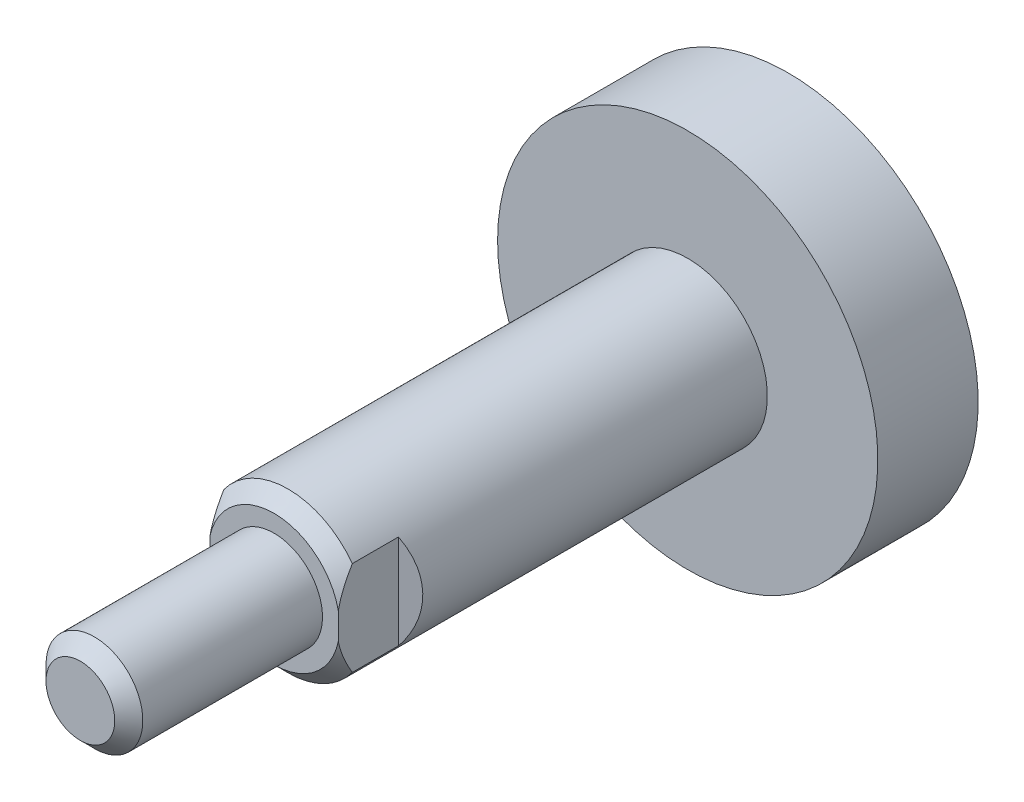
ISO-10303-21;
HEADER;
FILE_DESCRIPTION(('STEP AP214'),'2;1');
FILE_NAME('part.step','',(''),(''),'','','');
FILE_SCHEMA(('AUTOMOTIVE_DESIGN { 1 0 10303 214 1 1 1 1 }'));
ENDSEC;
DATA;
#1=APPLICATION_CONTEXT('core data for automotive mechanical design processes');
#2=APPLICATION_PROTOCOL_DEFINITION('international standard','automotive_design',2000,#1);
#3=PRODUCT_CONTEXT('',#1,'mechanical');
#4=PRODUCT('Part','Part','',(#3));
#5=PRODUCT_RELATED_PRODUCT_CATEGORY('part','',(#4));
#6=PRODUCT_DEFINITION_FORMATION('','',#4);
#7=PRODUCT_DEFINITION_CONTEXT('part definition',#1,'design');
#8=PRODUCT_DEFINITION('design','',#6,#7);
#9=PRODUCT_DEFINITION_SHAPE('','',#8);
#10=(LENGTH_UNIT() NAMED_UNIT(*) SI_UNIT(.MILLI.,.METRE.));
#11=(NAMED_UNIT(*) PLANE_ANGLE_UNIT() SI_UNIT($,.RADIAN.));
#12=(NAMED_UNIT(*) SI_UNIT($,.STERADIAN.) SOLID_ANGLE_UNIT());
#13=UNCERTAINTY_MEASURE_WITH_UNIT(LENGTH_MEASURE(1.E-05),#10,'distance_accuracy_value','');
#14=(GEOMETRIC_REPRESENTATION_CONTEXT(3) GLOBAL_UNCERTAINTY_ASSIGNED_CONTEXT((#13)) GLOBAL_UNIT_ASSIGNED_CONTEXT((#10,
#11,#12)) REPRESENTATION_CONTEXT('',''));
#15=CARTESIAN_POINT('',(0.,0.,0.));
#16=DIRECTION('',(0.,0.,1.));
#17=DIRECTION('',(1.,0.,0.));
#18=AXIS2_PLACEMENT_3D('',#15,#16,#17);
#19=CARTESIAN_POINT('',(0.,0.,35.266));
#20=DIRECTION('',(0.,0.,1.));
#21=DIRECTION('',(1.,0.,0.));
#22=AXIS2_PLACEMENT_3D('',#19,#20,#21);
#23=PLANE('',#22);
#24=CARTESIAN_POINT('',(0.,0.,35.2659999999219));
#25=DIRECTION('',(0.,0.,-1.));
#26=DIRECTION('',(-1.,0.,0.));
#27=AXIS2_PLACEMENT_3D('',#24,#25,#26);
#28=CIRCLE('',#27,1.71299999999519);
#29=CARTESIAN_POINT('',(-1.71299999999519,0.,35.2659999999219));
#30=VERTEX_POINT('',#29);
#31=EDGE_CURVE('E21',#30,#30,#28,.T.);
#32=ORIENTED_EDGE('',*,*,#31,.F.);
#33=EDGE_LOOP('',(#32));
#34=FACE_BOUND('',#33,.T.);
#35=ADVANCED_FACE('F18',(#34),#23,.T.);
#36=CARTESIAN_POINT('',(0.,0.,34.5659999999839));
#37=DIRECTION('',(0.,0.,-1.));
#38=DIRECTION('',(-1.,0.,0.));
#39=AXIS2_PLACEMENT_3D('',#36,#37,#38);
#40=CONICAL_SURFACE('',#39,2.41299999993316,0.785398163397448);
#41=ORIENTED_EDGE('',*,*,#31,.T.);
#42=EDGE_LOOP('',(#41));
#43=FACE_BOUND('',#42,.T.);
#44=CARTESIAN_POINT('',(0.,0.,34.566));
#45=DIRECTION('',(0.,0.,-1.));
#46=DIRECTION('',(-1.,0.,0.));
#47=AXIS2_PLACEMENT_3D('',#44,#45,#46);
#48=CIRCLE('',#47,2.413);
#49=CARTESIAN_POINT('',(-2.413,0.,34.566));
#50=VERTEX_POINT('',#49);
#51=EDGE_CURVE('E191',#50,#50,#48,.T.);
#52=ORIENTED_EDGE('',*,*,#51,.F.);
#53=EDGE_LOOP('',(#52));
#54=FACE_BOUND('',#53,.T.);
#55=ADVANCED_FACE('F199',(#43,#54),#40,.T.);
#56=CARTESIAN_POINT('',(0.,0.,35.266));
#57=DIRECTION('',(0.,0.,-1.));
#58=DIRECTION('',(-1.,0.,0.));
#59=AXIS2_PLACEMENT_3D('',#56,#57,#58);
#60=CYLINDRICAL_SURFACE('',#59,2.413);
#61=ORIENTED_EDGE('',*,*,#51,.T.);
#62=EDGE_LOOP('',(#61));
#63=FACE_BOUND('',#62,.T.);
#64=CARTESIAN_POINT('',(0.,0.,25.614));
#65=DIRECTION('',(0.,0.,-1.));
#66=DIRECTION('',(-1.,0.,0.));
#67=AXIS2_PLACEMENT_3D('',#64,#65,#66);
#68=CIRCLE('',#67,2.413);
#69=CARTESIAN_POINT('',(-2.413,0.,25.614));
#70=VERTEX_POINT('',#69);
#71=EDGE_CURVE('E73',#70,#70,#68,.F.);
#72=ORIENTED_EDGE('',*,*,#71,.T.);
#73=EDGE_LOOP('',(#72));
#74=FACE_BOUND('',#73,.T.);
#75=ADVANCED_FACE('F205',(#63,#74),#60,.T.);
#76=CARTESIAN_POINT('',(0.,0.,25.614));
#77=DIRECTION('',(0.,0.,-1.));
#78=DIRECTION('',(0.,1.,0.));
#79=AXIS2_PLACEMENT_3D('',#76,#77,#78);
#80=PLANE('',#79);
#81=ORIENTED_EDGE('',*,*,#71,.F.);
#82=EDGE_LOOP('',(#81));
#83=FACE_BOUND('',#82,.T.);
#84=DIRECTION('',(0.,1.,0.));
#85=VECTOR('',#84,1.);
#86=CARTESIAN_POINT('',(3.2,-9.475,25.614));
#87=LINE('',#86,#85);
#88=CARTESIAN_POINT('',(3.2,-0.668102537170798,25.6139999999809));
#89=VERTEX_POINT('',#88);
#90=CARTESIAN_POINT('',(3.2,0.668102537154727,25.6139999999842));
#91=VERTEX_POINT('',#90);
#92=EDGE_CURVE('E66',#89,#91,#87,.T.);
#93=ORIENTED_EDGE('',*,*,#92,.T.);
#94=CARTESIAN_POINT('',(0.,0.,25.6139999999618));
#95=DIRECTION('',(0.,0.,-1.));
#96=DIRECTION('',(0.,1.,0.));
#97=AXIS2_PLACEMENT_3D('',#94,#95,#96);
#98=CIRCLE('',#97,3.26900000004571);
#99=CARTESIAN_POINT('',(-3.2,0.668102537155263,25.6139999999841));
#100=VERTEX_POINT('',#99);
#101=EDGE_CURVE('E90',#100,#91,#98,.T.);
#102=ORIENTED_EDGE('',*,*,#101,.F.);
#103=DIRECTION('',(0.,1.,0.));
#104=VECTOR('',#103,1.);
#105=CARTESIAN_POINT('',(-3.2,-9.475,25.614));
#106=LINE('',#105,#104);
#107=CARTESIAN_POINT('',(-3.2,-0.668102537154732,25.6139999999842));
#108=VERTEX_POINT('',#107);
#109=EDGE_CURVE('E67',#100,#108,#106,.F.);
#110=ORIENTED_EDGE('',*,*,#109,.T.);
#111=CARTESIAN_POINT('',(0.,0.,25.6139999999618));
#112=DIRECTION('',(0.,0.,-1.));
#113=DIRECTION('',(0.,1.,0.));
#114=AXIS2_PLACEMENT_3D('',#111,#112,#113);
#115=CIRCLE('',#114,3.26900000004571);
#116=EDGE_CURVE('E62',#89,#108,#115,.T.);
#117=ORIENTED_EDGE('',*,*,#116,.F.);
#118=EDGE_LOOP('',(#93,#102,#110,#117));
#119=FACE_BOUND('',#118,.T.);
#120=ADVANCED_FACE('F64',(#83,#119),#80,.F.);
#121=CARTESIAN_POINT('',(0.,0.,24.9140000000807));
#122=DIRECTION('',(0.,0.,-1.));
#123=DIRECTION('',(0.,1.,0.));
#124=AXIS2_PLACEMENT_3D('',#121,#122,#123);
#125=CONICAL_SURFACE('',#124,3.96899999998368,0.785398163438051);
#126=CARTESIAN_POINT('',(-3.20000000000324,-0.668102537045559,25.6140000000079));
#127=CARTESIAN_POINT('',(-3.20000000000116,-0.791923989307162,25.5887118948215));
#128=CARTESIAN_POINT('',(-3.20000000000031,-0.914214432197644,25.5569533814339));
#129=CARTESIAN_POINT('',(-3.19999999999969,-1.15522323067472,25.482786734809));
#130=CARTESIAN_POINT('',(-3.19999999999992,-1.27394966585461,25.440405109426));
#131=CARTESIAN_POINT('',(-3.20000000000008,-1.50692397331803,25.3475394481742));
#132=CARTESIAN_POINT('',(-3.20000000000002,-1.62120166838874,25.2971285477279));
#133=CARTESIAN_POINT('',(-3.19999999999998,-1.8466563464418,25.1897204575799));
#134=CARTESIAN_POINT('',(-3.2,-1.95783200288132,25.1327205021669));
#135=CARTESIAN_POINT('',(-3.2,-2.1147772258552,25.047544782855));
#136=CARTESIAN_POINT('',(-3.2,-2.161701362435,25.021462011141));
#137=CARTESIAN_POINT('',(-3.2,-2.25515024754835,24.9683835316909));
#138=CARTESIAN_POINT('',(-3.2,-2.30167405357722,24.9413861634868));
#139=CARTESIAN_POINT('',(-3.2,-2.34796954838271,24.9140000000477));
#140=B_SPLINE_CURVE_WITH_KNOTS('',3,(#126,#127,#128,#129,#130,#131,#132,#133,#134,#135,#136,
#137,#138,#139),.UNSPECIFIED.,.F.,.F.,(4,2,2,2,2,2,4),(0.,0.378663318923574,0.756391005243895,
1.13085654278463,1.50547983437227,1.66653163363144,1.82789340191547),.UNSPECIFIED.);
#141=CARTESIAN_POINT('',(-3.2,-2.3479695483686,24.9140000000238));
#142=VERTEX_POINT('',#141);
#143=EDGE_CURVE('E116',#108,#142,#140,.T.);
#144=ORIENTED_EDGE('',*,*,#143,.T.);
#145=CARTESIAN_POINT('',(0.,0.,24.914));
#146=DIRECTION('',(0.,0.,-1.));
#147=DIRECTION('',(-1.,0.,0.));
#148=AXIS2_PLACEMENT_3D('',#145,#146,#147);
#149=CIRCLE('',#148,3.969);
#150=CARTESIAN_POINT('',(3.2,-2.3479695483686,24.9140000000238));
#151=VERTEX_POINT('',#150);
#152=EDGE_CURVE('E86',#151,#142,#149,.T.);
#153=ORIENTED_EDGE('',*,*,#152,.F.);
#154=CARTESIAN_POINT('',(3.2,-2.34796954838271,24.9140000000477));
#155=CARTESIAN_POINT('',(3.2,-2.28227540638902,24.9528576848915));
#156=CARTESIAN_POINT('',(3.2,-2.21612013329714,24.9909397042438));
#157=CARTESIAN_POINT('',(3.2,-2.08277615458881,25.065293160087));
#158=CARTESIAN_POINT('',(3.2,-2.01558715530726,25.1015640691656));
#159=CARTESIAN_POINT('',(3.2,-1.81330543751406,25.2067462963586));
#160=CARTESIAN_POINT('',(3.2,-1.6765834937986,25.2725768397312));
#161=CARTESIAN_POINT('',(3.2,-1.39788707534561,25.3932563066866));
#162=CARTESIAN_POINT('',(3.2,-1.25590184064602,25.4480810761872));
#163=CARTESIAN_POINT('',(3.2,-0.966123687795267,25.5431571719073));
#164=CARTESIAN_POINT('',(3.2,-0.81829778980787,25.5833066541209));
#165=CARTESIAN_POINT('',(3.2,-0.668102537044839,25.6140000000067));
#166=B_SPLINE_CURVE_WITH_KNOTS('',3,(#154,#155,#156,#157,#158,#159,#160,#161,#162,#163,#164,
#165),.UNSPECIFIED.,.F.,.F.,(4,2,2,2,2,4),(0.,0.228972156487963,0.458010607517393,
0.91289148643811,1.36876002116686,1.82773469580556),.UNSPECIFIED.);
#167=EDGE_CURVE('E79',#151,#89,#166,.T.);
#168=ORIENTED_EDGE('',*,*,#167,.T.);
#169=ORIENTED_EDGE('',*,*,#116,.T.);
#170=EDGE_LOOP('',(#144,#153,#168,#169));
#171=FACE_BOUND('',#170,.T.);
#172=ADVANCED_FACE('F85',(#171),#125,.T.);
#173=CARTESIAN_POINT('',(3.2,-9.475,22.614));
#174=DIRECTION('',(-0.500000000000005,0.,-0.866025403784436));
#175=DIRECTION('',(-0.866025403784436,0.,0.500000000000005));
#176=AXIS2_PLACEMENT_3D('',#173,#174,#175);
#177=PLANE('',#176);
#178=CARTESIAN_POINT('',(0.,0.,24.4615208614068));
#179=DIRECTION('',(-0.500000000000005,0.,-0.866025403784436));
#180=DIRECTION('',(0.866025403784436,0.,-0.500000000000005));
#181=AXIS2_PLACEMENT_3D('',#178,#179,#180);
#182=ELLIPSE('',#181,4.58300643682726,3.969);
#183=CARTESIAN_POINT('',(3.2,2.34796954835449,22.614));
#184=VERTEX_POINT('',#183);
#185=CARTESIAN_POINT('',(3.2,-2.34796954835449,22.614));
#186=VERTEX_POINT('',#185);
#187=EDGE_CURVE('E175',#184,#186,#182,.T.);
#188=ORIENTED_EDGE('',*,*,#187,.F.);
#189=DIRECTION('',(0.,1.,0.));
#190=VECTOR('',#189,1.);
#191=CARTESIAN_POINT('',(3.2,-9.475,22.614));
#192=LINE('',#191,#190);
#193=EDGE_CURVE('E87',#184,#186,#192,.F.);
#194=ORIENTED_EDGE('',*,*,#193,.T.);
#195=EDGE_LOOP('',(#188,#194));
#196=FACE_BOUND('',#195,.T.);
#197=ADVANCED_FACE('F111',(#196),#177,.F.);
#198=CARTESIAN_POINT('',(-3.2,-9.475,22.614));
#199=DIRECTION('',(0.500000000000004,0.,-0.866025403784436));
#200=DIRECTION('',(-0.866025403784436,0.,-0.500000000000004));
#201=AXIS2_PLACEMENT_3D('',#198,#199,#200);
#202=PLANE('',#201);
#203=CARTESIAN_POINT('',(0.,0.,24.4615208614068));
#204=DIRECTION('',(0.500000000000004,0.,-0.866025403784436));
#205=DIRECTION('',(-0.866025403784436,0.,-0.500000000000004));
#206=AXIS2_PLACEMENT_3D('',#203,#204,#205);
#207=ELLIPSE('',#206,4.58300643682726,3.969);
#208=CARTESIAN_POINT('',(-3.2,-2.34796954835449,22.614));
#209=VERTEX_POINT('',#208);
#210=CARTESIAN_POINT('',(-3.2,2.34796954835449,22.614));
#211=VERTEX_POINT('',#210);
#212=EDGE_CURVE('E172',#209,#211,#207,.T.);
#213=ORIENTED_EDGE('',*,*,#212,.F.);
#214=DIRECTION('',(0.,1.,0.));
#215=VECTOR('',#214,1.);
#216=CARTESIAN_POINT('',(-3.2,-9.475,22.614));
#217=LINE('',#216,#215);
#218=EDGE_CURVE('E72',#209,#211,#217,.T.);
#219=ORIENTED_EDGE('',*,*,#218,.T.);
#220=EDGE_LOOP('',(#213,#219));
#221=FACE_BOUND('',#220,.T.);
#222=ADVANCED_FACE('F129',(#221),#202,.F.);
#223=CARTESIAN_POINT('',(-3.2,-9.475,25.614));
#224=DIRECTION('',(1.,0.,0.));
#225=DIRECTION('',(0.,0.,-1.));
#226=AXIS2_PLACEMENT_3D('',#223,#224,#225);
#227=PLANE('',#226);
#228=ORIENTED_EDGE('',*,*,#143,.F.);
#229=ORIENTED_EDGE('',*,*,#109,.F.);
#230=CARTESIAN_POINT('',(-3.19999999998987,2.34796954838807,24.9140000000384));
#231=CARTESIAN_POINT('',(-3.19999999999627,2.28227540639574,24.9528576848853));
#232=CARTESIAN_POINT('',(-3.19999999999898,2.21612013330425,24.9909397042391));
#233=CARTESIAN_POINT('',(-3.20000000000102,2.08277615459583,25.0652931600838));
#234=CARTESIAN_POINT('',(-3.20000000000036,2.01558715531381,25.1015640691624));
#235=CARTESIAN_POINT('',(-3.19999999999929,1.81330543751945,25.2067462963555));
#236=CARTESIAN_POINT('',(-3.1999999999998,1.67658349380355,25.2725768397288));
#237=CARTESIAN_POINT('',(-3.2000000000002,1.39788707534955,25.3932563066852));
#238=CARTESIAN_POINT('',(-3.2000000000001,1.2559018406494,25.4480810761861));
#239=CARTESIAN_POINT('',(-3.1999999999999,0.966123687797418,25.5431571719066));
#240=CARTESIAN_POINT('',(-3.19999999999979,0.818297789809342,25.5833066541205));
#241=CARTESIAN_POINT('',(-3.2,0.668102537045687,25.6140000000065));
#242=B_SPLINE_CURVE_WITH_KNOTS('',3,(#230,#231,#232,#233,#234,#235,#236,#237,#238,#239,#240,
#241),.UNSPECIFIED.,.F.,.F.,(4,2,2,2,2,4),(0.,0.228972156489184,0.458010607519769,
0.912891486442607,1.3687600211732,1.82773469581398),.UNSPECIFIED.);
#243=CARTESIAN_POINT('',(-3.2,2.34796954835449,24.9140000000322));
#244=VERTEX_POINT('',#243);
#245=EDGE_CURVE('E121',#244,#100,#242,.T.);
#246=ORIENTED_EDGE('',*,*,#245,.F.);
#247=DIRECTION('',(0.,0.,-1.));
#248=VECTOR('',#247,1.);
#249=CARTESIAN_POINT('',(-3.2,2.34796954835449,36.8400272581176));
#250=LINE('',#249,#248);
#251=EDGE_CURVE('E174',#211,#244,#250,.F.);
#252=ORIENTED_EDGE('',*,*,#251,.F.);
#253=ORIENTED_EDGE('',*,*,#218,.F.);
#254=DIRECTION('',(0.,0.,-1.));
#255=VECTOR('',#254,1.);
#256=CARTESIAN_POINT('',(-3.2,-2.34796954835449,36.8400272581176));
#257=LINE('',#256,#255);
#258=EDGE_CURVE('E177',#142,#209,#257,.T.);
#259=ORIENTED_EDGE('',*,*,#258,.F.);
#260=EDGE_LOOP('',(#228,#229,#246,#252,#253,#259));
#261=FACE_BOUND('',#260,.T.);
#262=ADVANCED_FACE('F125',(#261),#227,.F.);
#263=CARTESIAN_POINT('',(0.,0.,24.9140000000807));
#264=DIRECTION('',(0.,0.,-1.));
#265=DIRECTION('',(0.,1.,0.));
#266=AXIS2_PLACEMENT_3D('',#263,#264,#265);
#267=CONICAL_SURFACE('',#266,3.96899999998368,0.785398163438051);
#268=ORIENTED_EDGE('',*,*,#245,.T.);
#269=ORIENTED_EDGE('',*,*,#101,.T.);
#270=CARTESIAN_POINT('',(3.20000000000325,0.668102537045564,25.6140000000079));
#271=CARTESIAN_POINT('',(3.20000000000117,0.791923989307168,25.5887118948215));
#272=CARTESIAN_POINT('',(3.20000000000031,0.914214432197651,25.5569533814339));
#273=CARTESIAN_POINT('',(3.19999999999969,1.15522323067473,25.482786734809));
#274=CARTESIAN_POINT('',(3.19999999999992,1.27394966585462,25.440405109426));
#275=CARTESIAN_POINT('',(3.20000000000008,1.50692397331804,25.3475394481742));
#276=CARTESIAN_POINT('',(3.20000000000003,1.62120166838875,25.2971285477279));
#277=CARTESIAN_POINT('',(3.19999999999998,1.84665634644181,25.1897204575799));
#278=CARTESIAN_POINT('',(3.2,1.95783200288133,25.1327205021669));
#279=CARTESIAN_POINT('',(3.20000000000001,2.11477722585521,25.0475447828549));
#280=CARTESIAN_POINT('',(3.2,2.161701362435,25.021462011141));
#281=CARTESIAN_POINT('',(3.2,2.25515024754835,24.9683835316909));
#282=CARTESIAN_POINT('',(3.2,2.30167405357722,24.9413861634868));
#283=CARTESIAN_POINT('',(3.2,2.34796954838271,24.9140000000477));
#284=B_SPLINE_CURVE_WITH_KNOTS('',3,(#270,#271,#272,#273,#274,#275,#276,#277,#278,#279,#280,
#281,#282,#283),.UNSPECIFIED.,.F.,.F.,(4,2,2,2,2,2,4),(0.,0.378663318923575,0.756391005243901,
1.13085654278463,1.50547983437227,1.66653163363144,1.82789340191546),.UNSPECIFIED.);
#285=CARTESIAN_POINT('',(3.2,2.3479695483686,24.9140000000238));
#286=VERTEX_POINT('',#285);
#287=EDGE_CURVE('E82',#91,#286,#284,.T.);
#288=ORIENTED_EDGE('',*,*,#287,.T.);
#289=CARTESIAN_POINT('',(0.,0.,24.914));
#290=DIRECTION('',(0.,0.,-1.));
#291=DIRECTION('',(-1.,0.,0.));
#292=AXIS2_PLACEMENT_3D('',#289,#290,#291);
#293=CIRCLE('',#292,3.969);
#294=EDGE_CURVE('E36',#244,#286,#293,.T.);
#295=ORIENTED_EDGE('',*,*,#294,.F.);
#296=EDGE_LOOP('',(#268,#269,#288,#295));
#297=FACE_BOUND('',#296,.T.);
#298=ADVANCED_FACE('F128',(#297),#267,.T.);
#299=CARTESIAN_POINT('',(3.2,-9.475,25.614));
#300=DIRECTION('',(-1.,0.,0.));
#301=DIRECTION('',(0.,0.,1.));
#302=AXIS2_PLACEMENT_3D('',#299,#300,#301);
#303=PLANE('',#302);
#304=ORIENTED_EDGE('',*,*,#287,.F.);
#305=ORIENTED_EDGE('',*,*,#92,.F.);
#306=ORIENTED_EDGE('',*,*,#167,.F.);
#307=DIRECTION('',(0.,0.,-1.));
#308=VECTOR('',#307,1.);
#309=CARTESIAN_POINT('',(3.20000000000001,-2.34796954835449,36.8400272581176));
#310=LINE('',#309,#308);
#311=EDGE_CURVE('E182',#186,#151,#310,.F.);
#312=ORIENTED_EDGE('',*,*,#311,.F.);
#313=ORIENTED_EDGE('',*,*,#193,.F.);
#314=DIRECTION('',(0.,0.,-1.));
#315=VECTOR('',#314,1.);
#316=CARTESIAN_POINT('',(3.2,2.34796954835449,36.8400272581176));
#317=LINE('',#316,#315);
#318=EDGE_CURVE('E166',#286,#184,#317,.T.);
#319=ORIENTED_EDGE('',*,*,#318,.F.);
#320=EDGE_LOOP('',(#304,#305,#306,#312,#313,#319));
#321=FACE_BOUND('',#320,.T.);
#322=ADVANCED_FACE('F77',(#321),#303,.F.);
#323=CARTESIAN_POINT('',(0.,0.,36.8400272581176));
#324=DIRECTION('',(0.,0.,-1.));
#325=DIRECTION('',(-1.,0.,0.));
#326=AXIS2_PLACEMENT_3D('',#323,#324,#325);
#327=CYLINDRICAL_SURFACE('',#326,3.969);
#328=CARTESIAN_POINT('',(0.,0.,5.));
#329=DIRECTION('',(0.,0.,-1.));
#330=DIRECTION('',(-1.,0.,0.));
#331=AXIS2_PLACEMENT_3D('',#328,#329,#330);
#332=CIRCLE('',#331,3.969);
#333=CARTESIAN_POINT('',(-3.969,0.,5.));
#334=VERTEX_POINT('',#333);
#335=EDGE_CURVE('E164',#334,#334,#332,.T.);
#336=ORIENTED_EDGE('',*,*,#335,.F.);
#337=EDGE_LOOP('',(#336));
#338=FACE_BOUND('',#337,.T.);
#339=ORIENTED_EDGE('',*,*,#294,.T.);
#340=ORIENTED_EDGE('',*,*,#318,.T.);
#341=ORIENTED_EDGE('',*,*,#187,.T.);
#342=ORIENTED_EDGE('',*,*,#311,.T.);
#343=ORIENTED_EDGE('',*,*,#152,.T.);
#344=ORIENTED_EDGE('',*,*,#258,.T.);
#345=ORIENTED_EDGE('',*,*,#212,.T.);
#346=ORIENTED_EDGE('',*,*,#251,.T.);
#347=EDGE_LOOP('',(#339,#340,#341,#342,#343,#344,#345,#346));
#348=FACE_BOUND('',#347,.T.);
#349=ADVANCED_FACE('F155',(#338,#348),#327,.T.);
#350=CARTESIAN_POINT('',(0.,0.,5.));
#351=DIRECTION('',(0.,0.,1.));
#352=DIRECTION('',(1.,0.,0.));
#353=AXIS2_PLACEMENT_3D('',#350,#351,#352);
#354=PLANE('',#353);
#355=CARTESIAN_POINT('',(0.,0.,5.));
#356=DIRECTION('',(0.,0.,-1.));
#357=DIRECTION('',(-1.,0.,0.));
#358=AXIS2_PLACEMENT_3D('',#355,#356,#357);
#359=CIRCLE('',#358,9.475);
#360=CARTESIAN_POINT('',(-9.475,0.,5.));
#361=VERTEX_POINT('',#360);
#362=EDGE_CURVE('E27',#361,#361,#359,.T.);
#363=ORIENTED_EDGE('',*,*,#362,.F.);
#364=EDGE_LOOP('',(#363));
#365=FACE_BOUND('',#364,.T.);
#366=ORIENTED_EDGE('',*,*,#335,.T.);
#367=EDGE_LOOP('',(#366));
#368=FACE_BOUND('',#367,.T.);
#369=ADVANCED_FACE('F149',(#365,#368),#354,.T.);
#370=CARTESIAN_POINT('',(0.,0.,5.));
#371=DIRECTION('',(0.,0.,-1.));
#372=DIRECTION('',(-1.,0.,0.));
#373=AXIS2_PLACEMENT_3D('',#370,#371,#372);
#374=CYLINDRICAL_SURFACE('',#373,9.475);
#375=ORIENTED_EDGE('',*,*,#362,.T.);
#376=EDGE_LOOP('',(#375));
#377=FACE_BOUND('',#376,.T.);
#378=CARTESIAN_POINT('',(0.,0.,0.));
#379=DIRECTION('',(0.,0.,-1.));
#380=DIRECTION('',(-1.,0.,0.));
#381=AXIS2_PLACEMENT_3D('',#378,#379,#380);
#382=CIRCLE('',#381,9.475);
#383=CARTESIAN_POINT('',(-9.475,0.,0.));
#384=VERTEX_POINT('',#383);
#385=EDGE_CURVE('E11',#384,#384,#382,.F.);
#386=ORIENTED_EDGE('',*,*,#385,.T.);
#387=EDGE_LOOP('',(#386));
#388=FACE_BOUND('',#387,.T.);
#389=ADVANCED_FACE('F143',(#377,#388),#374,.T.);
#390=CARTESIAN_POINT('',(0.,0.,0.));
#391=DIRECTION('',(0.,0.,1.));
#392=DIRECTION('',(1.,0.,0.));
#393=AXIS2_PLACEMENT_3D('',#390,#391,#392);
#394=PLANE('',#393);
#395=ORIENTED_EDGE('',*,*,#385,.F.);
#396=EDGE_LOOP('',(#395));
#397=FACE_BOUND('',#396,.T.);
#398=ADVANCED_FACE('F141',(#397),#394,.F.);
#399=CLOSED_SHELL('',(#35,#55,#75,#120,#172,#197,#222,#262,#298,#322,#349,#369,#389,#398));
#400=MANIFOLD_SOLID_BREP('B1',#399);
#401=ADVANCED_BREP_SHAPE_REPRESENTATION('',(#18,#400),#14);
#402=SHAPE_DEFINITION_REPRESENTATION(#9,#401);
ENDSEC;
END-ISO-10303-21;
